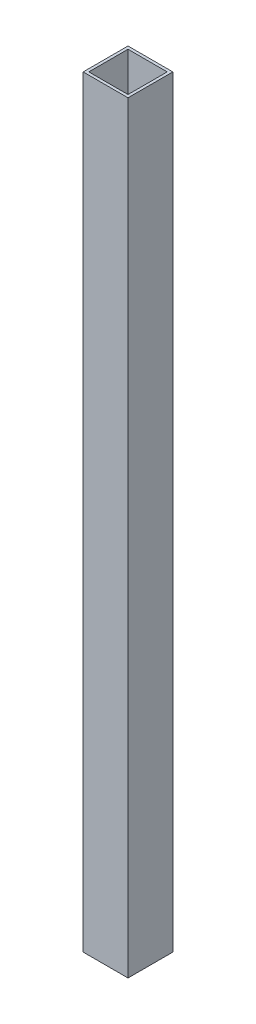
ISO-10303-21;
HEADER;
FILE_DESCRIPTION(('STEP AP214'),'2;1');
FILE_NAME('part.step','',(''),(''),'','','');
FILE_SCHEMA(('AUTOMOTIVE_DESIGN { 1 0 10303 214 1 1 1 1 }'));
ENDSEC;
DATA;
#1=APPLICATION_CONTEXT('core data for automotive mechanical design processes');
#2=APPLICATION_PROTOCOL_DEFINITION('international standard','automotive_design',2000,#1);
#3=PRODUCT_CONTEXT('',#1,'mechanical');
#4=PRODUCT('Part','Part','',(#3));
#5=PRODUCT_RELATED_PRODUCT_CATEGORY('part','',(#4));
#6=PRODUCT_DEFINITION_FORMATION('','',#4);
#7=PRODUCT_DEFINITION_CONTEXT('part definition',#1,'design');
#8=PRODUCT_DEFINITION('design','',#6,#7);
#9=PRODUCT_DEFINITION_SHAPE('','',#8);
#10=(LENGTH_UNIT() NAMED_UNIT(*) SI_UNIT(.MILLI.,.METRE.));
#11=(NAMED_UNIT(*) PLANE_ANGLE_UNIT() SI_UNIT($,.RADIAN.));
#12=(NAMED_UNIT(*) SI_UNIT($,.STERADIAN.) SOLID_ANGLE_UNIT());
#13=UNCERTAINTY_MEASURE_WITH_UNIT(LENGTH_MEASURE(1.E-05),#10,'distance_accuracy_value','');
#14=(GEOMETRIC_REPRESENTATION_CONTEXT(3) GLOBAL_UNCERTAINTY_ASSIGNED_CONTEXT((#13)) GLOBAL_UNIT_ASSIGNED_CONTEXT((#10,
#11,#12)) REPRESENTATION_CONTEXT('',''));
#15=CARTESIAN_POINT('',(0.,0.,0.));
#16=DIRECTION('',(0.,0.,1.));
#17=DIRECTION('',(1.,0.,0.));
#18=AXIS2_PLACEMENT_3D('',#15,#16,#17);
#19=CARTESIAN_POINT('',(0.,431.8,0.));
#20=DIRECTION('',(0.,1.,0.));
#21=DIRECTION('',(0.,0.,1.));
#22=AXIS2_PLACEMENT_3D('',#19,#20,#21);
#23=PLANE('',#22);
#24=DIRECTION('',(0.,0.,1.));
#25=VECTOR('',#24,1.);
#26=CARTESIAN_POINT('',(-12.7,431.8,12.7));
#27=LINE('',#26,#25);
#28=CARTESIAN_POINT('',(-12.7,431.8,-12.7));
#29=VERTEX_POINT('',#28);
#30=CARTESIAN_POINT('',(-12.7,431.8,12.7));
#31=VERTEX_POINT('',#30);
#32=EDGE_CURVE('E134',#29,#31,#27,.T.);
#33=ORIENTED_EDGE('',*,*,#32,.T.);
#34=DIRECTION('',(1.,0.,0.));
#35=VECTOR('',#34,1.);
#36=CARTESIAN_POINT('',(12.7,431.8,12.7));
#37=LINE('',#36,#35);
#38=CARTESIAN_POINT('',(12.7,431.8,12.7));
#39=VERTEX_POINT('',#38);
#40=EDGE_CURVE('E137',#31,#39,#37,.T.);
#41=ORIENTED_EDGE('',*,*,#40,.T.);
#42=DIRECTION('',(0.,0.,-1.));
#43=VECTOR('',#42,1.);
#44=CARTESIAN_POINT('',(12.7,431.8,12.7));
#45=LINE('',#44,#43);
#46=CARTESIAN_POINT('',(12.7,431.8,-12.7));
#47=VERTEX_POINT('',#46);
#48=EDGE_CURVE('E140',#39,#47,#45,.T.);
#49=ORIENTED_EDGE('',*,*,#48,.T.);
#50=DIRECTION('',(-1.,0.,0.));
#51=VECTOR('',#50,1.);
#52=CARTESIAN_POINT('',(12.7,431.8,-12.7));
#53=LINE('',#52,#51);
#54=EDGE_CURVE('E142',#47,#29,#53,.T.);
#55=ORIENTED_EDGE('',*,*,#54,.T.);
#56=EDGE_LOOP('',(#33,#41,#49,#55));
#57=FACE_BOUND('',#56,.T.);
#58=DIRECTION('',(-1.,0.,0.));
#59=VECTOR('',#58,1.);
#60=CARTESIAN_POINT('',(11.1125,431.8,-11.1125));
#61=LINE('',#60,#59);
#62=CARTESIAN_POINT('',(11.1125,431.8,-11.1125));
#63=VERTEX_POINT('',#62);
#64=CARTESIAN_POINT('',(-11.1125,431.8,-11.1125));
#65=VERTEX_POINT('',#64);
#66=EDGE_CURVE('E106',#63,#65,#61,.T.);
#67=ORIENTED_EDGE('',*,*,#66,.F.);
#68=DIRECTION('',(0.,0.,-1.));
#69=VECTOR('',#68,1.);
#70=CARTESIAN_POINT('',(11.1125,431.8,11.1125));
#71=LINE('',#70,#69);
#72=CARTESIAN_POINT('',(11.1125,431.8,11.1125));
#73=VERTEX_POINT('',#72);
#74=EDGE_CURVE('E98',#73,#63,#71,.T.);
#75=ORIENTED_EDGE('',*,*,#74,.F.);
#76=DIRECTION('',(1.,0.,0.));
#77=VECTOR('',#76,1.);
#78=CARTESIAN_POINT('',(11.1125,431.8,11.1125));
#79=LINE('',#78,#77);
#80=CARTESIAN_POINT('',(-11.1125,431.8,11.1125));
#81=VERTEX_POINT('',#80);
#82=EDGE_CURVE('E120',#81,#73,#79,.T.);
#83=ORIENTED_EDGE('',*,*,#82,.F.);
#84=DIRECTION('',(0.,0.,1.));
#85=VECTOR('',#84,1.);
#86=CARTESIAN_POINT('',(-11.1125,431.8,11.1125));
#87=LINE('',#86,#85);
#88=EDGE_CURVE('E118',#65,#81,#87,.T.);
#89=ORIENTED_EDGE('',*,*,#88,.F.);
#90=EDGE_LOOP('',(#67,#75,#83,#89));
#91=FACE_BOUND('',#90,.T.);
#92=ADVANCED_FACE('F33',(#57,#91),#23,.T.);
#93=CARTESIAN_POINT('',(0.,0.,0.));
#94=DIRECTION('',(0.,1.,0.));
#95=DIRECTION('',(0.,0.,1.));
#96=AXIS2_PLACEMENT_3D('',#93,#94,#95);
#97=PLANE('',#96);
#98=DIRECTION('',(0.,0.,1.));
#99=VECTOR('',#98,1.);
#100=CARTESIAN_POINT('',(-12.7,0.,12.7));
#101=LINE('',#100,#99);
#102=CARTESIAN_POINT('',(-12.7,0.,-12.7));
#103=VERTEX_POINT('',#102);
#104=CARTESIAN_POINT('',(-12.7,0.,12.7));
#105=VERTEX_POINT('',#104);
#106=EDGE_CURVE('E114',#103,#105,#101,.T.);
#107=ORIENTED_EDGE('',*,*,#106,.F.);
#108=DIRECTION('',(-1.,0.,0.));
#109=VECTOR('',#108,1.);
#110=CARTESIAN_POINT('',(12.7,0.,-12.7));
#111=LINE('',#110,#109);
#112=CARTESIAN_POINT('',(12.7,0.,-12.7));
#113=VERTEX_POINT('',#112);
#114=EDGE_CURVE('E138',#113,#103,#111,.T.);
#115=ORIENTED_EDGE('',*,*,#114,.F.);
#116=DIRECTION('',(0.,0.,-1.));
#117=VECTOR('',#116,1.);
#118=CARTESIAN_POINT('',(12.7,0.,12.7));
#119=LINE('',#118,#117);
#120=CARTESIAN_POINT('',(12.7,0.,12.7));
#121=VERTEX_POINT('',#120);
#122=EDGE_CURVE('E149',#121,#113,#119,.T.);
#123=ORIENTED_EDGE('',*,*,#122,.F.);
#124=DIRECTION('',(1.,0.,0.));
#125=VECTOR('',#124,1.);
#126=CARTESIAN_POINT('',(12.7,0.,12.7));
#127=LINE('',#126,#125);
#128=EDGE_CURVE('E147',#105,#121,#127,.T.);
#129=ORIENTED_EDGE('',*,*,#128,.F.);
#130=EDGE_LOOP('',(#107,#115,#123,#129));
#131=FACE_BOUND('',#130,.T.);
#132=DIRECTION('',(0.,0.,-1.));
#133=VECTOR('',#132,1.);
#134=CARTESIAN_POINT('',(11.1125,0.,11.1125));
#135=LINE('',#134,#133);
#136=CARTESIAN_POINT('',(11.1125,0.,11.1125));
#137=VERTEX_POINT('',#136);
#138=CARTESIAN_POINT('',(11.1125,0.,-11.1125));
#139=VERTEX_POINT('',#138);
#140=EDGE_CURVE('E56',#137,#139,#135,.T.);
#141=ORIENTED_EDGE('',*,*,#140,.T.);
#142=DIRECTION('',(-1.,0.,0.));
#143=VECTOR('',#142,1.);
#144=CARTESIAN_POINT('',(11.1125,0.,-11.1125));
#145=LINE('',#144,#143);
#146=CARTESIAN_POINT('',(-11.1125,0.,-11.1125));
#147=VERTEX_POINT('',#146);
#148=EDGE_CURVE('E113',#139,#147,#145,.T.);
#149=ORIENTED_EDGE('',*,*,#148,.T.);
#150=DIRECTION('',(0.,0.,1.));
#151=VECTOR('',#150,1.);
#152=CARTESIAN_POINT('',(-11.1125,0.,11.1125));
#153=LINE('',#152,#151);
#154=CARTESIAN_POINT('',(-11.1125,0.,11.1125));
#155=VERTEX_POINT('',#154);
#156=EDGE_CURVE('E126',#147,#155,#153,.T.);
#157=ORIENTED_EDGE('',*,*,#156,.T.);
#158=DIRECTION('',(1.,0.,0.));
#159=VECTOR('',#158,1.);
#160=CARTESIAN_POINT('',(11.1125,0.,11.1125));
#161=LINE('',#160,#159);
#162=EDGE_CURVE('E107',#155,#137,#161,.T.);
#163=ORIENTED_EDGE('',*,*,#162,.T.);
#164=EDGE_LOOP('',(#141,#149,#157,#163));
#165=FACE_BOUND('',#164,.T.);
#166=ADVANCED_FACE('F167',(#131,#165),#97,.F.);
#167=CARTESIAN_POINT('',(-12.7,431.8,12.7));
#168=DIRECTION('',(1.,0.,0.));
#169=DIRECTION('',(0.,0.,-1.));
#170=AXIS2_PLACEMENT_3D('',#167,#168,#169);
#171=PLANE('',#170);
#172=ORIENTED_EDGE('',*,*,#106,.T.);
#173=DIRECTION('',(0.,-1.,0.));
#174=VECTOR('',#173,1.);
#175=CARTESIAN_POINT('',(-12.7,431.8,12.7));
#176=LINE('',#175,#174);
#177=EDGE_CURVE('E11',#31,#105,#176,.T.);
#178=ORIENTED_EDGE('',*,*,#177,.F.);
#179=ORIENTED_EDGE('',*,*,#32,.F.);
#180=DIRECTION('',(0.,-1.,0.));
#181=VECTOR('',#180,1.);
#182=CARTESIAN_POINT('',(-12.7,431.8,-12.7));
#183=LINE('',#182,#181);
#184=EDGE_CURVE('E144',#29,#103,#183,.T.);
#185=ORIENTED_EDGE('',*,*,#184,.T.);
#186=EDGE_LOOP('',(#172,#178,#179,#185));
#187=FACE_BOUND('',#186,.T.);
#188=ADVANCED_FACE('F35',(#187),#171,.F.);
#189=CARTESIAN_POINT('',(12.7,431.8,12.7));
#190=DIRECTION('',(0.,0.,-1.));
#191=DIRECTION('',(-1.,0.,0.));
#192=AXIS2_PLACEMENT_3D('',#189,#190,#191);
#193=PLANE('',#192);
#194=ORIENTED_EDGE('',*,*,#128,.T.);
#195=DIRECTION('',(0.,-1.,0.));
#196=VECTOR('',#195,1.);
#197=CARTESIAN_POINT('',(12.7,431.8,12.7));
#198=LINE('',#197,#196);
#199=EDGE_CURVE('E41',#39,#121,#198,.T.);
#200=ORIENTED_EDGE('',*,*,#199,.F.);
#201=ORIENTED_EDGE('',*,*,#40,.F.);
#202=ORIENTED_EDGE('',*,*,#177,.T.);
#203=EDGE_LOOP('',(#194,#200,#201,#202));
#204=FACE_BOUND('',#203,.T.);
#205=ADVANCED_FACE('F177',(#204),#193,.F.);
#206=CARTESIAN_POINT('',(12.7,431.8,12.7));
#207=DIRECTION('',(-1.,0.,0.));
#208=DIRECTION('',(0.,0.,1.));
#209=AXIS2_PLACEMENT_3D('',#206,#207,#208);
#210=PLANE('',#209);
#211=ORIENTED_EDGE('',*,*,#122,.T.);
#212=DIRECTION('',(0.,-1.,0.));
#213=VECTOR('',#212,1.);
#214=CARTESIAN_POINT('',(12.7,431.8,-12.7));
#215=LINE('',#214,#213);
#216=EDGE_CURVE('E154',#47,#113,#215,.T.);
#217=ORIENTED_EDGE('',*,*,#216,.F.);
#218=ORIENTED_EDGE('',*,*,#48,.F.);
#219=ORIENTED_EDGE('',*,*,#199,.T.);
#220=EDGE_LOOP('',(#211,#217,#218,#219));
#221=FACE_BOUND('',#220,.T.);
#222=ADVANCED_FACE('F161',(#221),#210,.F.);
#223=CARTESIAN_POINT('',(12.7,431.8,-12.7));
#224=DIRECTION('',(0.,0.,1.));
#225=DIRECTION('',(1.,0.,0.));
#226=AXIS2_PLACEMENT_3D('',#223,#224,#225);
#227=PLANE('',#226);
#228=ORIENTED_EDGE('',*,*,#114,.T.);
#229=ORIENTED_EDGE('',*,*,#184,.F.);
#230=ORIENTED_EDGE('',*,*,#54,.F.);
#231=ORIENTED_EDGE('',*,*,#216,.T.);
#232=EDGE_LOOP('',(#228,#229,#230,#231));
#233=FACE_BOUND('',#232,.T.);
#234=ADVANCED_FACE('F171',(#233),#227,.F.);
#235=CARTESIAN_POINT('',(11.1125,431.8,11.1125));
#236=DIRECTION('',(-1.,0.,0.));
#237=DIRECTION('',(0.,0.,1.));
#238=AXIS2_PLACEMENT_3D('',#235,#236,#237);
#239=PLANE('',#238);
#240=ORIENTED_EDGE('',*,*,#140,.F.);
#241=DIRECTION('',(0.,-1.,0.));
#242=VECTOR('',#241,1.);
#243=CARTESIAN_POINT('',(11.1125,431.8,11.1125));
#244=LINE('',#243,#242);
#245=EDGE_CURVE('E102',#73,#137,#244,.T.);
#246=ORIENTED_EDGE('',*,*,#245,.F.);
#247=ORIENTED_EDGE('',*,*,#74,.T.);
#248=DIRECTION('',(0.,-1.,0.));
#249=VECTOR('',#248,1.);
#250=CARTESIAN_POINT('',(11.1125,431.8,-11.1125));
#251=LINE('',#250,#249);
#252=EDGE_CURVE('E101',#63,#139,#251,.T.);
#253=ORIENTED_EDGE('',*,*,#252,.T.);
#254=EDGE_LOOP('',(#240,#246,#247,#253));
#255=FACE_BOUND('',#254,.T.);
#256=ADVANCED_FACE('F100',(#255),#239,.T.);
#257=CARTESIAN_POINT('',(11.1125,431.8,-11.1125));
#258=DIRECTION('',(0.,0.,1.));
#259=DIRECTION('',(1.,0.,0.));
#260=AXIS2_PLACEMENT_3D('',#257,#258,#259);
#261=PLANE('',#260);
#262=ORIENTED_EDGE('',*,*,#148,.F.);
#263=ORIENTED_EDGE('',*,*,#252,.F.);
#264=ORIENTED_EDGE('',*,*,#66,.T.);
#265=DIRECTION('',(0.,-1.,0.));
#266=VECTOR('',#265,1.);
#267=CARTESIAN_POINT('',(-11.1125,431.8,-11.1125));
#268=LINE('',#267,#266);
#269=EDGE_CURVE('E115',#65,#147,#268,.T.);
#270=ORIENTED_EDGE('',*,*,#269,.T.);
#271=EDGE_LOOP('',(#262,#263,#264,#270));
#272=FACE_BOUND('',#271,.T.);
#273=ADVANCED_FACE('F110',(#272),#261,.T.);
#274=CARTESIAN_POINT('',(-11.1125,431.8,11.1125));
#275=DIRECTION('',(1.,0.,0.));
#276=DIRECTION('',(0.,0.,-1.));
#277=AXIS2_PLACEMENT_3D('',#274,#275,#276);
#278=PLANE('',#277);
#279=ORIENTED_EDGE('',*,*,#156,.F.);
#280=ORIENTED_EDGE('',*,*,#269,.F.);
#281=ORIENTED_EDGE('',*,*,#88,.T.);
#282=DIRECTION('',(0.,-1.,0.));
#283=VECTOR('',#282,1.);
#284=CARTESIAN_POINT('',(-11.1125,431.8,11.1125));
#285=LINE('',#284,#283);
#286=EDGE_CURVE('E48',#81,#155,#285,.T.);
#287=ORIENTED_EDGE('',*,*,#286,.T.);
#288=EDGE_LOOP('',(#279,#280,#281,#287));
#289=FACE_BOUND('',#288,.T.);
#290=ADVANCED_FACE('F200',(#289),#278,.T.);
#291=CARTESIAN_POINT('',(11.1125,431.8,11.1125));
#292=DIRECTION('',(0.,0.,-1.));
#293=DIRECTION('',(-1.,0.,0.));
#294=AXIS2_PLACEMENT_3D('',#291,#292,#293);
#295=PLANE('',#294);
#296=ORIENTED_EDGE('',*,*,#162,.F.);
#297=ORIENTED_EDGE('',*,*,#286,.F.);
#298=ORIENTED_EDGE('',*,*,#82,.T.);
#299=ORIENTED_EDGE('',*,*,#245,.T.);
#300=EDGE_LOOP('',(#296,#297,#298,#299));
#301=FACE_BOUND('',#300,.T.);
#302=ADVANCED_FACE('F204',(#301),#295,.T.);
#303=CLOSED_SHELL('',(#92,#166,#188,#205,#222,#234,#256,#273,#290,#302));
#304=MANIFOLD_SOLID_BREP('B2',#303);
#305=ADVANCED_BREP_SHAPE_REPRESENTATION('',(#18,#304),#14);
#306=SHAPE_DEFINITION_REPRESENTATION(#9,#305);
ENDSEC;
END-ISO-10303-21;
